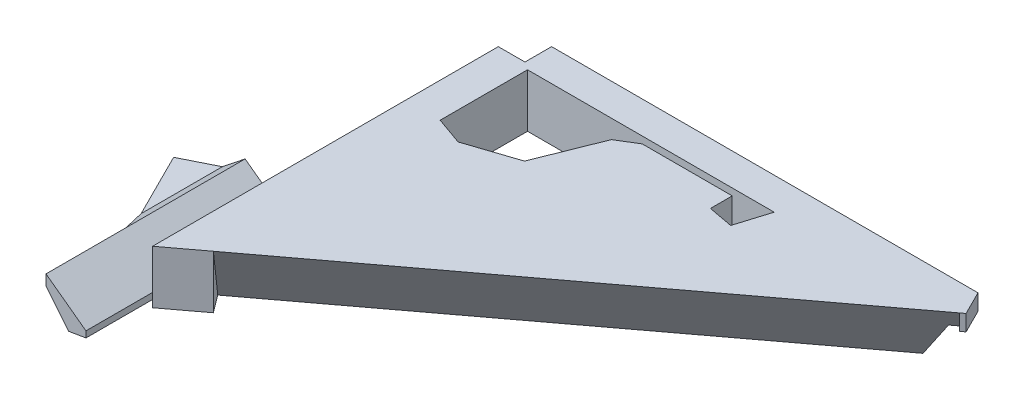
ISO-10303-21;
HEADER;
FILE_DESCRIPTION(('STEP AP214'),'2;1');
FILE_NAME('part.step','',(''),(''),'','','');
FILE_SCHEMA(('AUTOMOTIVE_DESIGN { 1 0 10303 214 1 1 1 1 }'));
ENDSEC;
DATA;
#1=APPLICATION_CONTEXT('core data for automotive mechanical design processes');
#2=APPLICATION_PROTOCOL_DEFINITION('international standard','automotive_design',2000,#1);
#3=PRODUCT_CONTEXT('',#1,'mechanical');
#4=PRODUCT('Part','Part','',(#3));
#5=PRODUCT_RELATED_PRODUCT_CATEGORY('part','',(#4));
#6=PRODUCT_DEFINITION_FORMATION('','',#4);
#7=PRODUCT_DEFINITION_CONTEXT('part definition',#1,'design');
#8=PRODUCT_DEFINITION('design','',#6,#7);
#9=PRODUCT_DEFINITION_SHAPE('','',#8);
#10=(LENGTH_UNIT() NAMED_UNIT(*) SI_UNIT(.MILLI.,.METRE.));
#11=(NAMED_UNIT(*) PLANE_ANGLE_UNIT() SI_UNIT($,.RADIAN.));
#12=(NAMED_UNIT(*) SI_UNIT($,.STERADIAN.) SOLID_ANGLE_UNIT());
#13=UNCERTAINTY_MEASURE_WITH_UNIT(LENGTH_MEASURE(1.E-05),#10,'distance_accuracy_value','');
#14=(GEOMETRIC_REPRESENTATION_CONTEXT(3) GLOBAL_UNCERTAINTY_ASSIGNED_CONTEXT((#13)) GLOBAL_UNIT_ASSIGNED_CONTEXT((#10,
#11,#12)) REPRESENTATION_CONTEXT('',''));
#15=CARTESIAN_POINT('',(0.,0.,0.));
#16=DIRECTION('',(0.,0.,1.));
#17=DIRECTION('',(1.,0.,0.));
#18=AXIS2_PLACEMENT_3D('',#15,#16,#17);
#19=CARTESIAN_POINT('',(221.579612662849,25.4,-102.940774674301));
#20=DIRECTION('',(-0.599773924536635,0.,-0.800169506695876));
#21=DIRECTION('',(-0.800169506695877,0.,0.599773924536636));
#22=AXIS2_PLACEMENT_3D('',#19,#20,#21);
#23=PLANE('',#22);
#24=DIRECTION('',(0.,-1.,0.));
#25=VECTOR('',#24,1.);
#26=CARTESIAN_POINT('',(219.79086032495,25.4,-101.6));
#27=LINE('',#26,#25);
#28=CARTESIAN_POINT('',(219.79086032495,25.4,-101.6));
#29=VERTEX_POINT('',#28);
#30=CARTESIAN_POINT('',(219.79086032495,17.78,-101.6));
#31=VERTEX_POINT('',#30);
#32=EDGE_CURVE('E290',#29,#31,#27,.T.);
#33=ORIENTED_EDGE('',*,*,#32,.T.);
#34=DIRECTION('',(0.800169506695877,0.,-0.599773924536636));
#35=VECTOR('',#34,1.);
#36=CARTESIAN_POINT('',(221.579612662849,17.78,-102.940774674301));
#37=LINE('',#36,#35);
#38=CARTESIAN_POINT('',(221.579612662849,17.78,-102.940774674301));
#39=VERTEX_POINT('',#38);
#40=EDGE_CURVE('E373',#31,#39,#37,.T.);
#41=ORIENTED_EDGE('',*,*,#40,.T.);
#42=DIRECTION('',(0.,-1.,0.));
#43=VECTOR('',#42,1.);
#44=CARTESIAN_POINT('',(221.579612662849,25.4,-102.940774674301));
#45=LINE('',#44,#43);
#46=CARTESIAN_POINT('',(221.579612662849,25.4,-102.940774674301));
#47=VERTEX_POINT('',#46);
#48=EDGE_CURVE('E481',#47,#39,#45,.T.);
#49=ORIENTED_EDGE('',*,*,#48,.F.);
#50=DIRECTION('',(0.800169506695876,0.,-0.599773924536635));
#51=VECTOR('',#50,1.);
#52=CARTESIAN_POINT('',(221.579612662849,25.4,-102.940774674301));
#53=LINE('',#52,#51);
#54=EDGE_CURVE('E454',#29,#47,#53,.T.);
#55=ORIENTED_EDGE('',*,*,#54,.F.);
#56=EDGE_LOOP('',(#33,#41,#49,#55));
#57=FACE_BOUND('',#56,.T.);
#58=ADVANCED_FACE('F74',(#57),#23,.F.);
#59=CARTESIAN_POINT('',(0.,25.4,0.));
#60=DIRECTION('',(0.,1.,0.));
#61=DIRECTION('',(0.,0.,1.));
#62=AXIS2_PLACEMENT_3D('',#59,#60,#61);
#63=PLANE('',#62);
#64=DIRECTION('',(0.,0.,1.));
#65=VECTOR('',#64,1.);
#66=CARTESIAN_POINT('',(0.,25.4,0.));
#67=LINE('',#66,#65);
#68=CARTESIAN_POINT('',(0.,25.4,-101.6));
#69=VERTEX_POINT('',#68);
#70=CARTESIAN_POINT('',(0.,25.4,63.1461266284947));
#71=VERTEX_POINT('',#70);
#72=EDGE_CURVE('E462',#69,#71,#67,.T.);
#73=ORIENTED_EDGE('',*,*,#72,.T.);
#74=CARTESIAN_POINT('',(16.5478056241978,25.4,50.7425768323053));
#75=VERTEX_POINT('',#74);
#76=EDGE_CURVE('E450',#71,#75,#53,.T.);
#77=ORIENTED_EDGE('',*,*,#76,.T.);
#78=DIRECTION('',(0.800169506695876,0.,-0.599773924536635));
#79=VECTOR('',#78,1.);
#80=CARTESIAN_POINT('',(16.5478056241978,25.4,50.7425768323053));
#81=LINE('',#80,#79);
#82=EDGE_CURVE('E279',#75,#29,#81,.T.);
#83=ORIENTED_EDGE('',*,*,#82,.T.);
#84=ORIENTED_EDGE('',*,*,#54,.T.);
#85=DIRECTION('',(-0.447213595499958,0.,-0.894427190999916));
#86=VECTOR('',#85,1.);
#87=CARTESIAN_POINT('',(215.9,25.4,-114.3));
#88=LINE('',#87,#86);
#89=CARTESIAN_POINT('',(215.9,25.4,-114.3));
#90=VERTEX_POINT('',#89);
#91=EDGE_CURVE('E453',#47,#90,#88,.T.);
#92=ORIENTED_EDGE('',*,*,#91,.T.);
#93=DIRECTION('',(-1.,0.,0.));
#94=VECTOR('',#93,1.);
#95=CARTESIAN_POINT('',(12.7,25.4,-114.3));
#96=LINE('',#95,#94);
#97=CARTESIAN_POINT('',(12.7,25.4,-114.3));
#98=VERTEX_POINT('',#97);
#99=EDGE_CURVE('E456',#90,#98,#96,.T.);
#100=ORIENTED_EDGE('',*,*,#99,.T.);
#101=DIRECTION('',(0.,0.,1.));
#102=VECTOR('',#101,1.);
#103=CARTESIAN_POINT('',(12.7,25.4,-101.6));
#104=LINE('',#103,#102);
#105=CARTESIAN_POINT('',(12.7,25.4,-101.6));
#106=VERTEX_POINT('',#105);
#107=EDGE_CURVE('E458',#98,#106,#104,.T.);
#108=ORIENTED_EDGE('',*,*,#107,.T.);
#109=DIRECTION('',(-1.,0.,0.));
#110=VECTOR('',#109,1.);
#111=CARTESIAN_POINT('',(0.,25.4,-101.6));
#112=LINE('',#111,#110);
#113=EDGE_CURVE('E460',#106,#69,#112,.T.);
#114=ORIENTED_EDGE('',*,*,#113,.T.);
#115=EDGE_LOOP('',(#73,#77,#83,#84,#92,#100,#108,#114));
#116=FACE_BOUND('',#115,.T.);
#117=DIRECTION('',(0.,0.,1.));
#118=VECTOR('',#117,1.);
#119=CARTESIAN_POINT('',(16.51,25.4,-99.0165349054092));
#120=LINE('',#119,#118);
#121=CARTESIAN_POINT('',(16.51,25.4,-99.0165349054092));
#122=VERTEX_POINT('',#121);
#123=CARTESIAN_POINT('',(16.51,25.4,-57.3806995480997));
#124=VERTEX_POINT('',#123);
#125=EDGE_CURVE('E379',#122,#124,#120,.T.);
#126=ORIENTED_EDGE('',*,*,#125,.F.);
#127=DIRECTION('',(-1.,0.,0.));
#128=VECTOR('',#127,1.);
#129=CARTESIAN_POINT('',(16.51,25.4,-99.0165349054092));
#130=LINE('',#129,#128);
#131=CARTESIAN_POINT('',(134.056716312534,25.4,-99.0165349054092));
#132=VERTEX_POINT('',#131);
#133=EDGE_CURVE('E377',#132,#122,#130,.T.);
#134=ORIENTED_EDGE('',*,*,#133,.F.);
#135=DIRECTION('',(0.293383061672796,0.,-0.955994968147582));
#136=VECTOR('',#135,1.);
#137=CARTESIAN_POINT('',(134.056716312534,25.4,-99.0165349054092));
#138=LINE('',#137,#136);
#139=CARTESIAN_POINT('',(129.190216348279,25.4,-83.1589409059752));
#140=VERTEX_POINT('',#139);
#141=EDGE_CURVE('E397',#140,#132,#138,.T.);
#142=ORIENTED_EDGE('',*,*,#141,.F.);
#143=DIRECTION('',(0.9831624870048,0.,0.182733478450274));
#144=VECTOR('',#143,1.);
#145=CARTESIAN_POINT('',(117.328122685408,25.4,-85.3636646066556));
#146=LINE('',#145,#144);
#147=CARTESIAN_POINT('',(117.328122685408,25.4,-85.3636646066556));
#148=VERTEX_POINT('',#147);
#149=EDGE_CURVE('E394',#148,#140,#146,.T.);
#150=ORIENTED_EDGE('',*,*,#149,.F.);
#151=DIRECTION('',(0.,0.,1.));
#152=VECTOR('',#151,1.);
#153=CARTESIAN_POINT('',(117.328122685408,25.4,-95.7484772476874));
#154=LINE('',#153,#152);
#155=CARTESIAN_POINT('',(117.328122685408,25.4,-95.7484772476874));
#156=VERTEX_POINT('',#155);
#157=EDGE_CURVE('E392',#156,#148,#154,.T.);
#158=ORIENTED_EDGE('',*,*,#157,.F.);
#159=DIRECTION('',(1.,0.,0.));
#160=VECTOR('',#159,1.);
#161=CARTESIAN_POINT('',(74.4224736154345,25.4,-95.7484772476874));
#162=LINE('',#161,#160);
#163=CARTESIAN_POINT('',(74.4224736154345,25.4,-95.7484772476874));
#164=VERTEX_POINT('',#163);
#165=EDGE_CURVE('E390',#164,#156,#162,.T.);
#166=ORIENTED_EDGE('',*,*,#165,.F.);
#167=DIRECTION('',(0.852266353638154,0.,-0.523108079135014));
#168=VECTOR('',#167,1.);
#169=CARTESIAN_POINT('',(74.4224736154345,25.4,-95.7484772476874));
#170=LINE('',#169,#168);
#171=CARTESIAN_POINT('',(65.3393873147147,25.4,-90.1734175177049));
#172=VERTEX_POINT('',#171);
#173=EDGE_CURVE('E388',#172,#164,#170,.T.);
#174=ORIENTED_EDGE('',*,*,#173,.F.);
#175=DIRECTION('',(0.372041831222485,0.,-0.928215963997937));
#176=VECTOR('',#175,1.);
#177=CARTESIAN_POINT('',(65.3393873147147,25.4,-90.1734175177049));
#178=LINE('',#177,#176);
#179=CARTESIAN_POINT('',(53.4907103043079,25.4,-60.6118730075718));
#180=VERTEX_POINT('',#179);
#181=EDGE_CURVE('E386',#180,#172,#178,.T.);
#182=ORIENTED_EDGE('',*,*,#181,.F.);
#183=DIRECTION('',(0.94850247826447,0.,-0.316769709293926));
#184=VECTOR('',#183,1.);
#185=CARTESIAN_POINT('',(29.76139092757,25.4,-52.6870338290113));
#186=LINE('',#185,#184);
#187=CARTESIAN_POINT('',(29.76139092757,25.4,-52.6870338290113));
#188=VERTEX_POINT('',#187);
#189=EDGE_CURVE('E384',#188,#180,#186,.T.);
#190=ORIENTED_EDGE('',*,*,#189,.F.);
#191=DIRECTION('',(0.942616820823999,0.,0.3338765177422));
#192=VECTOR('',#191,1.);
#193=CARTESIAN_POINT('',(16.51,25.4,-57.3806995480997));
#194=LINE('',#193,#192);
#195=EDGE_CURVE('E382',#124,#188,#194,.T.);
#196=ORIENTED_EDGE('',*,*,#195,.F.);
#197=EDGE_LOOP('',(#126,#134,#142,#150,#158,#166,#174,#182,#190,#196));
#198=FACE_BOUND('',#197,.T.);
#199=ADVANCED_FACE('F523',(#116,#198),#63,.T.);
#200=CARTESIAN_POINT('',(0.,0.,0.));
#201=DIRECTION('',(0.,1.,0.));
#202=DIRECTION('',(0.,0.,1.));
#203=AXIS2_PLACEMENT_3D('',#200,#201,#202);
#204=PLANE('',#203);
#205=DIRECTION('',(-1.,0.,0.));
#206=VECTOR('',#205,1.);
#207=CARTESIAN_POINT('',(0.,0.,-101.6));
#208=LINE('',#207,#206);
#209=CARTESIAN_POINT('',(202.384780424736,0.,-101.6));
#210=VERTEX_POINT('',#209);
#211=CARTESIAN_POINT('',(0.,0.,-101.6));
#212=VERTEX_POINT('',#211);
#213=EDGE_CURVE('E296',#210,#212,#208,.T.);
#214=ORIENTED_EDGE('',*,*,#213,.F.);
#215=DIRECTION('',(0.800169506695876,0.,-0.599773924536635));
#216=VECTOR('',#215,1.);
#217=CARTESIAN_POINT('',(10.2863380755884,0.,42.3890369490338));
#218=LINE('',#217,#216);
#219=CARTESIAN_POINT('',(10.2863380755884,0.,42.3890369490338));
#220=VERTEX_POINT('',#219);
#221=EDGE_CURVE('E276',#220,#210,#218,.T.);
#222=ORIENTED_EDGE('',*,*,#221,.F.);
#223=DIRECTION('',(-0.599773924536636,0.,-0.800169506695876));
#224=VECTOR('',#223,1.);
#225=CARTESIAN_POINT('',(16.5478056241978,0.,50.7425768323053));
#226=LINE('',#225,#224);
#227=CARTESIAN_POINT('',(16.5478056241978,0.,50.7425768323053));
#228=VERTEX_POINT('',#227);
#229=EDGE_CURVE('E283',#228,#220,#226,.T.);
#230=ORIENTED_EDGE('',*,*,#229,.F.);
#231=DIRECTION('',(0.800169506695876,0.,-0.599773924536635));
#232=VECTOR('',#231,1.);
#233=CARTESIAN_POINT('',(221.579612662849,0.,-102.940774674301));
#234=LINE('',#233,#232);
#235=CARTESIAN_POINT('',(0.,0.,63.1461266284947));
#236=VERTEX_POINT('',#235);
#237=EDGE_CURVE('E449',#236,#228,#234,.T.);
#238=ORIENTED_EDGE('',*,*,#237,.F.);
#239=DIRECTION('',(0.,0.,1.));
#240=VECTOR('',#239,1.);
#241=CARTESIAN_POINT('',(0.,0.,0.));
#242=LINE('',#241,#240);
#243=EDGE_CURVE('E466',#212,#236,#242,.T.);
#244=ORIENTED_EDGE('',*,*,#243,.F.);
#245=EDGE_LOOP('',(#214,#222,#230,#238,#244));
#246=FACE_BOUND('',#245,.T.);
#247=DIRECTION('',(-1.,0.,0.));
#248=VECTOR('',#247,1.);
#249=CARTESIAN_POINT('',(16.51,0.,-99.0165349054092));
#250=LINE('',#249,#248);
#251=CARTESIAN_POINT('',(134.056716312534,0.,-99.0165349054092));
#252=VERTEX_POINT('',#251);
#253=CARTESIAN_POINT('',(16.51,0.,-99.0165349054092));
#254=VERTEX_POINT('',#253);
#255=EDGE_CURVE('E376',#252,#254,#250,.T.);
#256=ORIENTED_EDGE('',*,*,#255,.T.);
#257=DIRECTION('',(0.,0.,1.));
#258=VECTOR('',#257,1.);
#259=CARTESIAN_POINT('',(16.51,0.,-99.0165349054092));
#260=LINE('',#259,#258);
#261=CARTESIAN_POINT('',(16.51,0.,-57.3806995480997));
#262=VERTEX_POINT('',#261);
#263=EDGE_CURVE('E402',#254,#262,#260,.T.);
#264=ORIENTED_EDGE('',*,*,#263,.T.);
#265=DIRECTION('',(0.942616820823999,0.,0.3338765177422));
#266=VECTOR('',#265,1.);
#267=CARTESIAN_POINT('',(16.51,0.,-57.3806995480997));
#268=LINE('',#267,#266);
#269=CARTESIAN_POINT('',(29.76139092757,0.,-52.6870338290113));
#270=VERTEX_POINT('',#269);
#271=EDGE_CURVE('E405',#262,#270,#268,.T.);
#272=ORIENTED_EDGE('',*,*,#271,.T.);
#273=DIRECTION('',(0.94850247826447,0.,-0.316769709293926));
#274=VECTOR('',#273,1.);
#275=CARTESIAN_POINT('',(29.76139092757,0.,-52.6870338290113));
#276=LINE('',#275,#274);
#277=CARTESIAN_POINT('',(53.4907103043079,0.,-60.6118730075718));
#278=VERTEX_POINT('',#277);
#279=EDGE_CURVE('E408',#270,#278,#276,.T.);
#280=ORIENTED_EDGE('',*,*,#279,.T.);
#281=DIRECTION('',(0.372041831222485,0.,-0.928215963997937));
#282=VECTOR('',#281,1.);
#283=CARTESIAN_POINT('',(65.3393873147147,0.,-90.1734175177049));
#284=LINE('',#283,#282);
#285=CARTESIAN_POINT('',(65.3393873147147,0.,-90.1734175177049));
#286=VERTEX_POINT('',#285);
#287=EDGE_CURVE('E411',#278,#286,#284,.T.);
#288=ORIENTED_EDGE('',*,*,#287,.T.);
#289=DIRECTION('',(0.852266353638154,0.,-0.523108079135014));
#290=VECTOR('',#289,1.);
#291=CARTESIAN_POINT('',(74.4224736154345,0.,-95.7484772476874));
#292=LINE('',#291,#290);
#293=CARTESIAN_POINT('',(74.4224736154345,0.,-95.7484772476874));
#294=VERTEX_POINT('',#293);
#295=EDGE_CURVE('E414',#286,#294,#292,.T.);
#296=ORIENTED_EDGE('',*,*,#295,.T.);
#297=DIRECTION('',(1.,0.,0.));
#298=VECTOR('',#297,1.);
#299=CARTESIAN_POINT('',(74.4224736154345,0.,-95.7484772476874));
#300=LINE('',#299,#298);
#301=CARTESIAN_POINT('',(117.328122685408,0.,-95.7484772476874));
#302=VERTEX_POINT('',#301);
#303=EDGE_CURVE('E417',#294,#302,#300,.T.);
#304=ORIENTED_EDGE('',*,*,#303,.T.);
#305=DIRECTION('',(0.,0.,1.));
#306=VECTOR('',#305,1.);
#307=CARTESIAN_POINT('',(117.328122685408,0.,-95.7484772476874));
#308=LINE('',#307,#306);
#309=CARTESIAN_POINT('',(117.328122685408,0.,-85.3636646066556));
#310=VERTEX_POINT('',#309);
#311=EDGE_CURVE('E420',#302,#310,#308,.T.);
#312=ORIENTED_EDGE('',*,*,#311,.T.);
#313=DIRECTION('',(0.9831624870048,0.,0.182733478450274));
#314=VECTOR('',#313,1.);
#315=CARTESIAN_POINT('',(117.328122685408,0.,-85.3636646066556));
#316=LINE('',#315,#314);
#317=CARTESIAN_POINT('',(129.190216348279,0.,-83.1589409059752));
#318=VERTEX_POINT('',#317);
#319=EDGE_CURVE('E423',#310,#318,#316,.T.);
#320=ORIENTED_EDGE('',*,*,#319,.T.);
#321=DIRECTION('',(0.293383061672796,0.,-0.955994968147582));
#322=VECTOR('',#321,1.);
#323=CARTESIAN_POINT('',(134.056716312534,0.,-99.0165349054092));
#324=LINE('',#323,#322);
#325=EDGE_CURVE('E380',#318,#252,#324,.T.);
#326=ORIENTED_EDGE('',*,*,#325,.T.);
#327=EDGE_LOOP('',(#256,#264,#272,#280,#288,#296,#304,#312,#320,#326));
#328=FACE_BOUND('',#327,.T.);
#329=ADVANCED_FACE('F293',(#246,#328),#204,.F.);
#330=CARTESIAN_POINT('',(-19.05,25.4,0.));
#331=DIRECTION('',(0.,0.,1.));
#332=DIRECTION('',(1.,0.,0.));
#333=AXIS2_PLACEMENT_3D('',#330,#331,#332);
#334=PLANE('',#333);
#335=DIRECTION('',(0.,-1.,0.));
#336=VECTOR('',#335,1.);
#337=CARTESIAN_POINT('',(-19.05,25.4,0.));
#338=LINE('',#337,#336);
#339=CARTESIAN_POINT('',(-19.05,20.3380251635927,0.));
#340=VERTEX_POINT('',#339);
#341=CARTESIAN_POINT('',(-19.05,15.3141480435858,0.));
#342=VERTEX_POINT('',#341);
#343=EDGE_CURVE('E497',#340,#342,#338,.T.);
#344=ORIENTED_EDGE('',*,*,#343,.F.);
#345=DIRECTION('',(-0.806041138326849,0.591859513165715,0.));
#346=VECTOR('',#345,1.);
#347=CARTESIAN_POINT('',(3.02935078483259,4.12560971088779,0.));
#348=LINE('',#347,#346);
#349=CARTESIAN_POINT('',(0.,6.35,0.));
#350=VERTEX_POINT('',#349);
#351=EDGE_CURVE('E304',#350,#340,#348,.T.);
#352=ORIENTED_EDGE('',*,*,#351,.F.);
#353=DIRECTION('',(0.,-1.,0.));
#354=VECTOR('',#353,1.);
#355=CARTESIAN_POINT('',(0.,25.4,0.));
#356=LINE('',#355,#354);
#357=CARTESIAN_POINT('',(0.,3.40974356356947,0.));
#358=VERTEX_POINT('',#357);
#359=EDGE_CURVE('E97',#350,#358,#356,.T.);
#360=ORIENTED_EDGE('',*,*,#359,.T.);
#361=DIRECTION('',(0.986273449876479,0.165120204907664,0.));
#362=VECTOR('',#361,1.);
#363=CARTESIAN_POINT('',(-0.555289267197707,3.31677798937278,0.));
#364=LINE('',#363,#362);
#365=CARTESIAN_POINT('',(-8.25422711955252,2.02783505380921,0.));
#366=VERTEX_POINT('',#365);
#367=EDGE_CURVE('E335',#366,#358,#364,.T.);
#368=ORIENTED_EDGE('',*,*,#367,.F.);
#369=DIRECTION('',(0.630615269276735,-0.776095601169747,0.));
#370=VECTOR('',#369,1.);
#371=CARTESIAN_POINT('',(-3.97926380788836,-3.23334459563035,0.));
#372=LINE('',#371,#370);
#373=EDGE_CURVE('E330',#342,#366,#372,.T.);
#374=ORIENTED_EDGE('',*,*,#373,.F.);
#375=EDGE_LOOP('',(#344,#352,#360,#368,#374));
#376=FACE_BOUND('',#375,.T.);
#377=ADVANCED_FACE('F76',(#376),#334,.F.);
#378=CARTESIAN_POINT('',(-41.7684506513979,25.4,11.3592253256989));
#379=DIRECTION('',(0.447213595499958,0.,0.894427190999916));
#380=DIRECTION('',(0.894427190999916,0.,-0.447213595499958));
#381=AXIS2_PLACEMENT_3D('',#378,#379,#380);
#382=PLANE('',#381);
#383=DIRECTION('',(0.,-1.,0.));
#384=VECTOR('',#383,1.);
#385=CARTESIAN_POINT('',(-41.7684506513979,25.4,11.3592253256989));
#386=LINE('',#385,#384);
#387=CARTESIAN_POINT('',(-41.7684506513978,15.3141480435858,11.359225325699));
#388=VERTEX_POINT('',#387);
#389=CARTESIAN_POINT('',(-41.7684506513979,10.7271298035795,11.3592253256989));
#390=VERTEX_POINT('',#389);
#391=EDGE_CURVE('E495',#388,#390,#386,.T.);
#392=ORIENTED_EDGE('',*,*,#391,.F.);
#393=DIRECTION('',(0.894427190999916,0.,-0.447213595499958));
#394=VECTOR('',#393,1.);
#395=CARTESIAN_POINT('',(-41.7684506513979,15.3141480435858,11.3592253256989));
#396=LINE('',#395,#394);
#397=CARTESIAN_POINT('',(-26.2794909941801,15.3141480435858,3.61474549709005));
#398=VERTEX_POINT('',#397);
#399=EDGE_CURVE('E327',#388,#398,#396,.T.);
#400=ORIENTED_EDGE('',*,*,#399,.T.);
#401=DIRECTION('',(0.759648178869514,0.527890429374591,-0.379824089434757));
#402=VECTOR('',#401,1.);
#403=CARTESIAN_POINT('',(-33.4076308985714,10.3607012514523,7.17881544928569));
#404=LINE('',#403,#402);
#405=EDGE_CURVE('E324',#398,#340,#404,.T.);
#406=ORIENTED_EDGE('',*,*,#405,.T.);
#407=ORIENTED_EDGE('',*,*,#343,.T.);
#408=DIRECTION('',(-0.777892474865148,-0.493562682883562,0.388946237432574));
#409=VECTOR('',#408,1.);
#410=CARTESIAN_POINT('',(-32.3617935715706,6.86798773034258,6.65589678578532));
#411=LINE('',#410,#409);
#412=CARTESIAN_POINT('',(-26.2794909941801,10.7271298035795,3.61474549709005));
#413=VERTEX_POINT('',#412);
#414=EDGE_CURVE('E357',#342,#413,#411,.T.);
#415=ORIENTED_EDGE('',*,*,#414,.T.);
#416=DIRECTION('',(-0.894427190999916,0.,0.447213595499958));
#417=VECTOR('',#416,1.);
#418=CARTESIAN_POINT('',(-41.7684506513979,10.7271298035795,11.3592253256989));
#419=LINE('',#418,#417);
#420=EDGE_CURVE('E360',#413,#390,#419,.T.);
#421=ORIENTED_EDGE('',*,*,#420,.T.);
#422=EDGE_LOOP('',(#392,#400,#406,#407,#415,#421));
#423=FACE_BOUND('',#422,.T.);
#424=ADVANCED_FACE('F582',(#423),#382,.F.);
#425=CARTESIAN_POINT('',(-19.05,25.4,56.7961266284946));
#426=DIRECTION('',(0.894427190999916,0.,-0.447213595499958));
#427=DIRECTION('',(-0.447213595499958,0.,-0.894427190999916));
#428=AXIS2_PLACEMENT_3D('',#425,#426,#427);
#429=PLANE('',#428);
#430=DIRECTION('',(-0.427065610296312,-0.29677402600496,-0.854131220592624));
#431=VECTOR('',#430,1.);
#432=CARTESIAN_POINT('',(-18.4084352838108,20.7838576988654,58.079256060873));
#433=LINE('',#432,#431);
#434=CARTESIAN_POINT('',(-19.05,20.3380251635927,56.7961266284946));
#435=VERTEX_POINT('',#434);
#436=CARTESIAN_POINT('',(-26.2794909941801,15.3141480435858,42.3371446401345));
#437=VERTEX_POINT('',#436);
#438=EDGE_CURVE('E314',#435,#437,#433,.T.);
#439=ORIENTED_EDGE('',*,*,#438,.T.);
#440=DIRECTION('',(-0.447213595499958,0.,-0.894427190999916));
#441=VECTOR('',#440,1.);
#442=CARTESIAN_POINT('',(-19.05,15.3141480435858,56.7961266284946));
#443=LINE('',#442,#441);
#444=EDGE_CURVE('E502',#437,#388,#443,.T.);
#445=ORIENTED_EDGE('',*,*,#444,.T.);
#446=ORIENTED_EDGE('',*,*,#391,.T.);
#447=DIRECTION('',(0.447213595499958,0.,0.894427190999916));
#448=VECTOR('',#447,1.);
#449=CARTESIAN_POINT('',(-19.05,10.7271298035795,56.7961266284946));
#450=LINE('',#449,#448);
#451=CARTESIAN_POINT('',(-26.2794909941801,10.7271298035795,42.3371446401346));
#452=VERTEX_POINT('',#451);
#453=EDGE_CURVE('E499',#390,#452,#450,.T.);
#454=ORIENTED_EDGE('',*,*,#453,.T.);
#455=DIRECTION('',(0.430228965743723,0.272974696950891,0.860457931487447));
#456=VECTOR('',#455,1.);
#457=CARTESIAN_POINT('',(-17.8655011915922,16.06569716977,59.1651242453103));
#458=LINE('',#457,#456);
#459=CARTESIAN_POINT('',(-19.05,15.3141480435858,56.7961266284946));
#460=VERTEX_POINT('',#459);
#461=EDGE_CURVE('E345',#452,#460,#458,.T.);
#462=ORIENTED_EDGE('',*,*,#461,.T.);
#463=DIRECTION('',(0.,-1.,0.));
#464=VECTOR('',#463,1.);
#465=CARTESIAN_POINT('',(-19.05,25.4,56.7961266284946));
#466=LINE('',#465,#464);
#467=EDGE_CURVE('E493',#435,#460,#466,.T.);
#468=ORIENTED_EDGE('',*,*,#467,.F.);
#469=EDGE_LOOP('',(#439,#445,#446,#454,#462,#468));
#470=FACE_BOUND('',#469,.T.);
#471=ADVANCED_FACE('F579',(#470),#429,.F.);
#472=CARTESIAN_POINT('',(-19.05,25.4,94.8961266284946));
#473=DIRECTION('',(1.,0.,0.));
#474=DIRECTION('',(0.,0.,-1.));
#475=AXIS2_PLACEMENT_3D('',#472,#473,#474);
#476=PLANE('',#475);
#477=DIRECTION('',(0.,-1.,0.));
#478=VECTOR('',#477,1.);
#479=CARTESIAN_POINT('',(-19.05,25.4,94.8961266284946));
#480=LINE('',#479,#478);
#481=CARTESIAN_POINT('',(-19.05,20.3380251635927,94.8961266284946));
#482=VERTEX_POINT('',#481);
#483=CARTESIAN_POINT('',(-19.05,15.3141480435858,94.8961266284946));
#484=VERTEX_POINT('',#483);
#485=EDGE_CURVE('E491',#482,#484,#480,.T.);
#486=ORIENTED_EDGE('',*,*,#485,.F.);
#487=DIRECTION('',(0.,0.,-1.));
#488=VECTOR('',#487,1.);
#489=CARTESIAN_POINT('',(-19.05,20.3380251635927,94.8961266284946));
#490=LINE('',#489,#488);
#491=EDGE_CURVE('E315',#482,#435,#490,.T.);
#492=ORIENTED_EDGE('',*,*,#491,.T.);
#493=ORIENTED_EDGE('',*,*,#467,.T.);
#494=DIRECTION('',(0.,0.,-1.));
#495=VECTOR('',#494,1.);
#496=CARTESIAN_POINT('',(-19.05,15.3141480435858,94.8961266284946));
#497=LINE('',#496,#495);
#498=EDGE_CURVE('E349',#484,#460,#497,.T.);
#499=ORIENTED_EDGE('',*,*,#498,.F.);
#500=EDGE_LOOP('',(#486,#492,#493,#499));
#501=FACE_BOUND('',#500,.T.);
#502=ADVANCED_FACE('F572',(#501),#476,.F.);
#503=CARTESIAN_POINT('',(0.,25.4,94.8961266284946));
#504=DIRECTION('',(0.,0.,-1.));
#505=DIRECTION('',(-1.,0.,0.));
#506=AXIS2_PLACEMENT_3D('',#503,#504,#505);
#507=PLANE('',#506);
#508=DIRECTION('',(0.,-1.,0.));
#509=VECTOR('',#508,1.);
#510=CARTESIAN_POINT('',(0.,25.4,94.8961266284946));
#511=LINE('',#510,#509);
#512=CARTESIAN_POINT('',(0.,6.35,94.8961266284946));
#513=VERTEX_POINT('',#512);
#514=CARTESIAN_POINT('',(0.,3.40974356356946,94.8961266284946));
#515=VERTEX_POINT('',#514);
#516=EDGE_CURVE('E488',#513,#515,#511,.T.);
#517=ORIENTED_EDGE('',*,*,#516,.F.);
#518=DIRECTION('',(-0.806041138326849,0.591859513165715,0.));
#519=VECTOR('',#518,1.);
#520=CARTESIAN_POINT('',(3.02935078483259,4.12560971088779,94.8961266284946));
#521=LINE('',#520,#519);
#522=EDGE_CURVE('E305',#513,#482,#521,.T.);
#523=ORIENTED_EDGE('',*,*,#522,.T.);
#524=ORIENTED_EDGE('',*,*,#485,.T.);
#525=DIRECTION('',(0.630615269276735,-0.776095601169747,0.));
#526=VECTOR('',#525,1.);
#527=CARTESIAN_POINT('',(-3.97926380788836,-3.23334459563035,94.8961266284946));
#528=LINE('',#527,#526);
#529=CARTESIAN_POINT('',(-8.25422711955252,2.02783505380921,94.8961266284946));
#530=VERTEX_POINT('',#529);
#531=EDGE_CURVE('E331',#484,#530,#528,.T.);
#532=ORIENTED_EDGE('',*,*,#531,.T.);
#533=DIRECTION('',(0.986273449876479,0.165120204907664,0.));
#534=VECTOR('',#533,1.);
#535=CARTESIAN_POINT('',(-0.555289267197707,3.31677798937278,94.8961266284946));
#536=LINE('',#535,#534);
#537=EDGE_CURVE('E334',#530,#515,#536,.T.);
#538=ORIENTED_EDGE('',*,*,#537,.T.);
#539=EDGE_LOOP('',(#517,#523,#524,#532,#538));
#540=FACE_BOUND('',#539,.T.);
#541=ADVANCED_FACE('F567',(#540),#507,.F.);
#542=CARTESIAN_POINT('',(0.,25.4,63.1461266284946));
#543=DIRECTION('',(-1.,0.,0.));
#544=DIRECTION('',(0.,0.,1.));
#545=AXIS2_PLACEMENT_3D('',#542,#543,#544);
#546=PLANE('',#545);
#547=DIRECTION('',(0.,-1.,0.));
#548=VECTOR('',#547,1.);
#549=CARTESIAN_POINT('',(0.,25.4,63.1461266284946));
#550=LINE('',#549,#548);
#551=CARTESIAN_POINT('',(0.,6.35,63.1461266284947));
#552=VERTEX_POINT('',#551);
#553=CARTESIAN_POINT('',(0.,3.40974356356946,63.1461266284947));
#554=VERTEX_POINT('',#553);
#555=EDGE_CURVE('E489',#552,#554,#550,.T.);
#556=ORIENTED_EDGE('',*,*,#555,.F.);
#557=DIRECTION('',(0.,0.,-1.));
#558=VECTOR('',#557,1.);
#559=CARTESIAN_POINT('',(0.,6.35,94.8961266284946));
#560=LINE('',#559,#558);
#561=EDGE_CURVE('E319',#513,#552,#560,.T.);
#562=ORIENTED_EDGE('',*,*,#561,.F.);
#563=ORIENTED_EDGE('',*,*,#516,.T.);
#564=DIRECTION('',(0.,0.,-1.));
#565=VECTOR('',#564,1.);
#566=CARTESIAN_POINT('',(0.,3.40974356356946,94.8961266284946));
#567=LINE('',#566,#565);
#568=EDGE_CURVE('E342',#515,#554,#567,.T.);
#569=ORIENTED_EDGE('',*,*,#568,.T.);
#570=EDGE_LOOP('',(#556,#562,#563,#569));
#571=FACE_BOUND('',#570,.T.);
#572=ADVANCED_FACE('F562',(#571),#546,.F.);
#573=ORIENTED_EDGE('',*,*,#237,.T.);
#574=DIRECTION('',(0.,-1.,0.));
#575=VECTOR('',#574,1.);
#576=CARTESIAN_POINT('',(16.5478056241978,25.4,50.7425768323053));
#577=LINE('',#576,#575);
#578=EDGE_CURVE('E282',#75,#228,#577,.T.);
#579=ORIENTED_EDGE('',*,*,#578,.F.);
#580=ORIENTED_EDGE('',*,*,#76,.F.);
#581=EDGE_CURVE('E485',#71,#552,#550,.T.);
#582=ORIENTED_EDGE('',*,*,#581,.T.);
#583=ORIENTED_EDGE('',*,*,#555,.T.);
#584=EDGE_CURVE('E484',#554,#236,#550,.T.);
#585=ORIENTED_EDGE('',*,*,#584,.T.);
#586=EDGE_LOOP('',(#573,#579,#580,#582,#583,#585));
#587=FACE_BOUND('',#586,.T.);
#588=ADVANCED_FACE('F530',(#587),#23,.F.);
#589=CARTESIAN_POINT('',(215.9,25.4,-114.3));
#590=DIRECTION('',(-0.894427190999916,0.,0.447213595499958));
#591=DIRECTION('',(0.447213595499958,0.,0.894427190999916));
#592=AXIS2_PLACEMENT_3D('',#589,#590,#591);
#593=PLANE('',#592);
#594=ORIENTED_EDGE('',*,*,#48,.T.);
#595=DIRECTION('',(-0.447213595499958,0.,-0.894427190999916));
#596=VECTOR('',#595,1.);
#597=CARTESIAN_POINT('',(215.9,17.78,-114.3));
#598=LINE('',#597,#596);
#599=CARTESIAN_POINT('',(215.9,17.78,-114.3));
#600=VERTEX_POINT('',#599);
#601=EDGE_CURVE('E369',#39,#600,#598,.T.);
#602=ORIENTED_EDGE('',*,*,#601,.T.);
#603=DIRECTION('',(0.,-1.,0.));
#604=VECTOR('',#603,1.);
#605=CARTESIAN_POINT('',(215.9,25.4,-114.3));
#606=LINE('',#605,#604);
#607=EDGE_CURVE('E478',#90,#600,#606,.T.);
#608=ORIENTED_EDGE('',*,*,#607,.F.);
#609=ORIENTED_EDGE('',*,*,#91,.F.);
#610=EDGE_LOOP('',(#594,#602,#608,#609));
#611=FACE_BOUND('',#610,.T.);
#612=ADVANCED_FACE('F515',(#611),#593,.F.);
#613=CARTESIAN_POINT('',(12.7,25.4,-114.3));
#614=DIRECTION('',(0.,0.,1.));
#615=DIRECTION('',(1.,0.,0.));
#616=AXIS2_PLACEMENT_3D('',#613,#614,#615);
#617=PLANE('',#616);
#618=ORIENTED_EDGE('',*,*,#607,.T.);
#619=DIRECTION('',(-1.,0.,0.));
#620=VECTOR('',#619,1.);
#621=CARTESIAN_POINT('',(221.579612662849,17.78,-114.3));
#622=LINE('',#621,#620);
#623=CARTESIAN_POINT('',(12.7,17.78,-114.3));
#624=VERTEX_POINT('',#623);
#625=EDGE_CURVE('E366',#600,#624,#622,.T.);
#626=ORIENTED_EDGE('',*,*,#625,.T.);
#627=DIRECTION('',(0.,-1.,0.));
#628=VECTOR('',#627,1.);
#629=CARTESIAN_POINT('',(12.7,25.4,-114.3));
#630=LINE('',#629,#628);
#631=EDGE_CURVE('E475',#98,#624,#630,.T.);
#632=ORIENTED_EDGE('',*,*,#631,.F.);
#633=ORIENTED_EDGE('',*,*,#99,.F.);
#634=EDGE_LOOP('',(#618,#626,#632,#633));
#635=FACE_BOUND('',#634,.T.);
#636=ADVANCED_FACE('F519',(#635),#617,.F.);
#637=CARTESIAN_POINT('',(12.7,25.4,-101.6));
#638=DIRECTION('',(1.,0.,0.));
#639=DIRECTION('',(0.,0.,-1.));
#640=AXIS2_PLACEMENT_3D('',#637,#638,#639);
#641=PLANE('',#640);
#642=ORIENTED_EDGE('',*,*,#631,.T.);
#643=DIRECTION('',(0.,0.,-1.));
#644=VECTOR('',#643,1.);
#645=CARTESIAN_POINT('',(12.7,17.78,-101.6));
#646=LINE('',#645,#644);
#647=CARTESIAN_POINT('',(12.7,17.78,-101.6));
#648=VERTEX_POINT('',#647);
#649=EDGE_CURVE('E363',#648,#624,#646,.T.);
#650=ORIENTED_EDGE('',*,*,#649,.F.);
#651=DIRECTION('',(0.,-1.,0.));
#652=VECTOR('',#651,1.);
#653=CARTESIAN_POINT('',(12.7,25.4,-101.6));
#654=LINE('',#653,#652);
#655=EDGE_CURVE('E472',#106,#648,#654,.T.);
#656=ORIENTED_EDGE('',*,*,#655,.F.);
#657=ORIENTED_EDGE('',*,*,#107,.F.);
#658=EDGE_LOOP('',(#642,#650,#656,#657));
#659=FACE_BOUND('',#658,.T.);
#660=ADVANCED_FACE('F544',(#659),#641,.F.);
#661=CARTESIAN_POINT('',(0.,25.4,-101.6));
#662=DIRECTION('',(0.,0.,1.));
#663=DIRECTION('',(1.,0.,0.));
#664=AXIS2_PLACEMENT_3D('',#661,#662,#663);
#665=PLANE('',#664);
#666=DIRECTION('',(-1.,0.,0.));
#667=VECTOR('',#666,1.);
#668=CARTESIAN_POINT('',(221.579612662849,17.78,-101.6));
#669=LINE('',#668,#667);
#670=CARTESIAN_POINT('',(214.569036354886,17.78,-101.6));
#671=VERTEX_POINT('',#670);
#672=EDGE_CURVE('E365',#671,#648,#669,.T.);
#673=ORIENTED_EDGE('',*,*,#672,.F.);
#674=DIRECTION('',(-0.565283954313478,-0.824896388036533,0.));
#675=VECTOR('',#674,1.);
#676=CARTESIAN_POINT('',(149.557581279946,-77.088630292976,-101.6));
#677=LINE('',#676,#675);
#678=EDGE_CURVE('E298',#671,#210,#677,.T.);
#679=ORIENTED_EDGE('',*,*,#678,.T.);
#680=ORIENTED_EDGE('',*,*,#213,.T.);
#681=DIRECTION('',(0.,-1.,0.));
#682=VECTOR('',#681,1.);
#683=CARTESIAN_POINT('',(0.,25.4,-101.6));
#684=LINE('',#683,#682);
#685=EDGE_CURVE('E469',#69,#212,#684,.T.);
#686=ORIENTED_EDGE('',*,*,#685,.F.);
#687=ORIENTED_EDGE('',*,*,#113,.F.);
#688=ORIENTED_EDGE('',*,*,#655,.T.);
#689=EDGE_LOOP('',(#673,#679,#680,#686,#687,#688));
#690=FACE_BOUND('',#689,.T.);
#691=ADVANCED_FACE('F541',(#690),#665,.F.);
#692=CARTESIAN_POINT('',(0.,25.4,0.));
#693=DIRECTION('',(1.,0.,0.));
#694=DIRECTION('',(0.,0.,-1.));
#695=AXIS2_PLACEMENT_3D('',#692,#693,#694);
#696=PLANE('',#695);
#697=ORIENTED_EDGE('',*,*,#243,.T.);
#698=ORIENTED_EDGE('',*,*,#584,.F.);
#699=EDGE_CURVE('E346',#554,#358,#567,.T.);
#700=ORIENTED_EDGE('',*,*,#699,.T.);
#701=ORIENTED_EDGE('',*,*,#359,.F.);
#702=EDGE_CURVE('E308',#552,#350,#560,.T.);
#703=ORIENTED_EDGE('',*,*,#702,.F.);
#704=ORIENTED_EDGE('',*,*,#581,.F.);
#705=ORIENTED_EDGE('',*,*,#72,.F.);
#706=ORIENTED_EDGE('',*,*,#685,.T.);
#707=EDGE_LOOP('',(#697,#698,#700,#701,#703,#704,#705,#706));
#708=FACE_BOUND('',#707,.T.);
#709=ADVANCED_FACE('F534',(#708),#696,.F.);
#710=CARTESIAN_POINT('',(16.51,25.4,-99.0165349054092));
#711=DIRECTION('',(0.,0.,1.));
#712=DIRECTION('',(1.,0.,0.));
#713=AXIS2_PLACEMENT_3D('',#710,#711,#712);
#714=PLANE('',#713);
#715=ORIENTED_EDGE('',*,*,#255,.F.);
#716=DIRECTION('',(0.,-1.,0.));
#717=VECTOR('',#716,1.);
#718=CARTESIAN_POINT('',(134.056716312534,25.4,-99.0165349054092));
#719=LINE('',#718,#717);
#720=EDGE_CURVE('E399',#132,#252,#719,.T.);
#721=ORIENTED_EDGE('',*,*,#720,.F.);
#722=ORIENTED_EDGE('',*,*,#133,.T.);
#723=DIRECTION('',(0.,-1.,0.));
#724=VECTOR('',#723,1.);
#725=CARTESIAN_POINT('',(16.51,25.4,-99.0165349054092));
#726=LINE('',#725,#724);
#727=EDGE_CURVE('E446',#122,#254,#726,.T.);
#728=ORIENTED_EDGE('',*,*,#727,.T.);
#729=EDGE_LOOP('',(#715,#721,#722,#728));
#730=FACE_BOUND('',#729,.T.);
#731=ADVANCED_FACE('F667',(#730),#714,.T.);
#732=CARTESIAN_POINT('',(16.51,25.4,-99.0165349054092));
#733=DIRECTION('',(1.,0.,0.));
#734=DIRECTION('',(0.,0.,-1.));
#735=AXIS2_PLACEMENT_3D('',#732,#733,#734);
#736=PLANE('',#735);
#737=ORIENTED_EDGE('',*,*,#263,.F.);
#738=ORIENTED_EDGE('',*,*,#727,.F.);
#739=ORIENTED_EDGE('',*,*,#125,.T.);
#740=DIRECTION('',(0.,-1.,0.));
#741=VECTOR('',#740,1.);
#742=CARTESIAN_POINT('',(16.51,25.4,-57.3806995480997));
#743=LINE('',#742,#741);
#744=EDGE_CURVE('E444',#124,#262,#743,.T.);
#745=ORIENTED_EDGE('',*,*,#744,.T.);
#746=EDGE_LOOP('',(#737,#738,#739,#745));
#747=FACE_BOUND('',#746,.T.);
#748=ADVANCED_FACE('F663',(#747),#736,.T.);
#749=CARTESIAN_POINT('',(16.51,25.4,-57.3806995480997));
#750=DIRECTION('',(0.3338765177422,0.,-0.942616820823999));
#751=DIRECTION('',(-0.942616820823999,0.,-0.3338765177422));
#752=AXIS2_PLACEMENT_3D('',#749,#750,#751);
#753=PLANE('',#752);
#754=ORIENTED_EDGE('',*,*,#271,.F.);
#755=ORIENTED_EDGE('',*,*,#744,.F.);
#756=ORIENTED_EDGE('',*,*,#195,.T.);
#757=DIRECTION('',(0.,-1.,0.));
#758=VECTOR('',#757,1.);
#759=CARTESIAN_POINT('',(29.76139092757,25.4,-52.6870338290113));
#760=LINE('',#759,#758);
#761=EDGE_CURVE('E442',#188,#270,#760,.T.);
#762=ORIENTED_EDGE('',*,*,#761,.T.);
#763=EDGE_LOOP('',(#754,#755,#756,#762));
#764=FACE_BOUND('',#763,.T.);
#765=ADVANCED_FACE('F659',(#764),#753,.T.);
#766=CARTESIAN_POINT('',(29.76139092757,25.4,-52.6870338290113));
#767=DIRECTION('',(-0.316769709293926,0.,-0.94850247826447));
#768=DIRECTION('',(-0.94850247826447,0.,0.316769709293926));
#769=AXIS2_PLACEMENT_3D('',#766,#767,#768);
#770=PLANE('',#769);
#771=ORIENTED_EDGE('',*,*,#279,.F.);
#772=ORIENTED_EDGE('',*,*,#761,.F.);
#773=ORIENTED_EDGE('',*,*,#189,.T.);
#774=DIRECTION('',(0.,-1.,0.));
#775=VECTOR('',#774,1.);
#776=CARTESIAN_POINT('',(53.4907103043079,25.4,-60.6118730075718));
#777=LINE('',#776,#775);
#778=EDGE_CURVE('E440',#180,#278,#777,.T.);
#779=ORIENTED_EDGE('',*,*,#778,.T.);
#780=EDGE_LOOP('',(#771,#772,#773,#779));
#781=FACE_BOUND('',#780,.T.);
#782=ADVANCED_FACE('F655',(#781),#770,.T.);
#783=CARTESIAN_POINT('',(65.3393873147147,25.4,-90.1734175177049));
#784=DIRECTION('',(-0.928215963997937,0.,-0.372041831222485));
#785=DIRECTION('',(-0.372041831222485,0.,0.928215963997937));
#786=AXIS2_PLACEMENT_3D('',#783,#784,#785);
#787=PLANE('',#786);
#788=ORIENTED_EDGE('',*,*,#287,.F.);
#789=ORIENTED_EDGE('',*,*,#778,.F.);
#790=ORIENTED_EDGE('',*,*,#181,.T.);
#791=DIRECTION('',(0.,-1.,0.));
#792=VECTOR('',#791,1.);
#793=CARTESIAN_POINT('',(65.3393873147147,25.4,-90.1734175177049));
#794=LINE('',#793,#792);
#795=EDGE_CURVE('E438',#172,#286,#794,.T.);
#796=ORIENTED_EDGE('',*,*,#795,.T.);
#797=EDGE_LOOP('',(#788,#789,#790,#796));
#798=FACE_BOUND('',#797,.T.);
#799=ADVANCED_FACE('F651',(#798),#787,.T.);
#800=CARTESIAN_POINT('',(74.4224736154345,25.4,-95.7484772476874));
#801=DIRECTION('',(-0.523108079135014,0.,-0.852266353638154));
#802=DIRECTION('',(-0.852266353638155,0.,0.523108079135014));
#803=AXIS2_PLACEMENT_3D('',#800,#801,#802);
#804=PLANE('',#803);
#805=ORIENTED_EDGE('',*,*,#295,.F.);
#806=ORIENTED_EDGE('',*,*,#795,.F.);
#807=ORIENTED_EDGE('',*,*,#173,.T.);
#808=DIRECTION('',(0.,-1.,0.));
#809=VECTOR('',#808,1.);
#810=CARTESIAN_POINT('',(74.4224736154345,25.4,-95.7484772476874));
#811=LINE('',#810,#809);
#812=EDGE_CURVE('E436',#164,#294,#811,.T.);
#813=ORIENTED_EDGE('',*,*,#812,.T.);
#814=EDGE_LOOP('',(#805,#806,#807,#813));
#815=FACE_BOUND('',#814,.T.);
#816=ADVANCED_FACE('F647',(#815),#804,.T.);
#817=CARTESIAN_POINT('',(74.4224736154345,25.4,-95.7484772476874));
#818=DIRECTION('',(0.,0.,-1.));
#819=DIRECTION('',(-1.,0.,0.));
#820=AXIS2_PLACEMENT_3D('',#817,#818,#819);
#821=PLANE('',#820);
#822=ORIENTED_EDGE('',*,*,#303,.F.);
#823=ORIENTED_EDGE('',*,*,#812,.F.);
#824=ORIENTED_EDGE('',*,*,#165,.T.);
#825=DIRECTION('',(0.,-1.,0.));
#826=VECTOR('',#825,1.);
#827=CARTESIAN_POINT('',(117.328122685408,25.4,-95.7484772476874));
#828=LINE('',#827,#826);
#829=EDGE_CURVE('E434',#156,#302,#828,.T.);
#830=ORIENTED_EDGE('',*,*,#829,.T.);
#831=EDGE_LOOP('',(#822,#823,#824,#830));
#832=FACE_BOUND('',#831,.T.);
#833=ADVANCED_FACE('F643',(#832),#821,.T.);
#834=CARTESIAN_POINT('',(117.328122685408,25.4,-95.7484772476874));
#835=DIRECTION('',(1.,0.,0.));
#836=DIRECTION('',(0.,0.,-1.));
#837=AXIS2_PLACEMENT_3D('',#834,#835,#836);
#838=PLANE('',#837);
#839=ORIENTED_EDGE('',*,*,#311,.F.);
#840=ORIENTED_EDGE('',*,*,#829,.F.);
#841=ORIENTED_EDGE('',*,*,#157,.T.);
#842=DIRECTION('',(0.,-1.,0.));
#843=VECTOR('',#842,1.);
#844=CARTESIAN_POINT('',(117.328122685408,25.4,-85.3636646066556));
#845=LINE('',#844,#843);
#846=EDGE_CURVE('E432',#148,#310,#845,.T.);
#847=ORIENTED_EDGE('',*,*,#846,.T.);
#848=EDGE_LOOP('',(#839,#840,#841,#847));
#849=FACE_BOUND('',#848,.T.);
#850=ADVANCED_FACE('F639',(#849),#838,.T.);
#851=CARTESIAN_POINT('',(117.328122685408,25.4,-85.3636646066556));
#852=DIRECTION('',(0.182733478450274,0.,-0.9831624870048));
#853=DIRECTION('',(-0.9831624870048,0.,-0.182733478450274));
#854=AXIS2_PLACEMENT_3D('',#851,#852,#853);
#855=PLANE('',#854);
#856=ORIENTED_EDGE('',*,*,#319,.F.);
#857=ORIENTED_EDGE('',*,*,#846,.F.);
#858=ORIENTED_EDGE('',*,*,#149,.T.);
#859=DIRECTION('',(0.,-1.,0.));
#860=VECTOR('',#859,1.);
#861=CARTESIAN_POINT('',(129.190216348279,25.4,-83.1589409059752));
#862=LINE('',#861,#860);
#863=EDGE_CURVE('E430',#140,#318,#862,.T.);
#864=ORIENTED_EDGE('',*,*,#863,.T.);
#865=EDGE_LOOP('',(#856,#857,#858,#864));
#866=FACE_BOUND('',#865,.T.);
#867=ADVANCED_FACE('F635',(#866),#855,.T.);
#868=CARTESIAN_POINT('',(134.056716312534,25.4,-99.0165349054092));
#869=DIRECTION('',(-0.955994968147582,0.,-0.293383061672796));
#870=DIRECTION('',(-0.293383061672796,0.,0.955994968147582));
#871=AXIS2_PLACEMENT_3D('',#868,#869,#870);
#872=PLANE('',#871);
#873=ORIENTED_EDGE('',*,*,#325,.F.);
#874=ORIENTED_EDGE('',*,*,#863,.F.);
#875=ORIENTED_EDGE('',*,*,#141,.T.);
#876=ORIENTED_EDGE('',*,*,#720,.T.);
#877=EDGE_LOOP('',(#873,#874,#875,#876));
#878=FACE_BOUND('',#877,.T.);
#879=ADVANCED_FACE('F632',(#878),#872,.T.);
#880=CARTESIAN_POINT('',(221.579612662849,17.78,-101.6));
#881=DIRECTION('',(0.,1.,0.));
#882=DIRECTION('',(0.,0.,1.));
#883=AXIS2_PLACEMENT_3D('',#880,#881,#882);
#884=PLANE('',#883);
#885=DIRECTION('',(0.599773924536636,0.,0.800169506695876));
#886=VECTOR('',#885,1.);
#887=CARTESIAN_POINT('',(220.434325986401,17.78,-100.741540537468));
#888=LINE('',#887,#886);
#889=CARTESIAN_POINT('',(217.912420060368,17.78,-104.106061964982));
#890=VERTEX_POINT('',#889);
#891=EDGE_CURVE('E82',#890,#31,#888,.T.);
#892=ORIENTED_EDGE('',*,*,#891,.F.);
#893=DIRECTION('',(-0.800169506695877,0.,0.599773924536635));
#894=VECTOR('',#893,1.);
#895=CARTESIAN_POINT('',(219.057706736816,17.78,-104.964521427514));
#896=LINE('',#895,#894);
#897=EDGE_CURVE('E12',#890,#671,#896,.T.);
#898=ORIENTED_EDGE('',*,*,#897,.T.);
#899=ORIENTED_EDGE('',*,*,#672,.T.);
#900=ORIENTED_EDGE('',*,*,#649,.T.);
#901=ORIENTED_EDGE('',*,*,#625,.F.);
#902=ORIENTED_EDGE('',*,*,#601,.F.);
#903=ORIENTED_EDGE('',*,*,#40,.F.);
#904=EDGE_LOOP('',(#892,#898,#899,#900,#901,#902,#903));
#905=FACE_BOUND('',#904,.T.);
#906=ADVANCED_FACE('F512',(#905),#884,.F.);
#907=CARTESIAN_POINT('',(0.,10.7271298035795,94.8961266284946));
#908=DIRECTION('',(0.,1.,0.));
#909=DIRECTION('',(0.,0.,1.));
#910=AXIS2_PLACEMENT_3D('',#907,#908,#909);
#911=PLANE('',#910);
#912=DIRECTION('',(0.,0.,-1.));
#913=VECTOR('',#912,1.);
#914=CARTESIAN_POINT('',(-26.2794909941801,10.7271298035795,94.8961266284946));
#915=LINE('',#914,#913);
#916=EDGE_CURVE('E338',#452,#413,#915,.T.);
#917=ORIENTED_EDGE('',*,*,#916,.F.);
#918=ORIENTED_EDGE('',*,*,#453,.F.);
#919=ORIENTED_EDGE('',*,*,#420,.F.);
#920=EDGE_LOOP('',(#917,#918,#919));
#921=FACE_BOUND('',#920,.T.);
#922=ADVANCED_FACE('F593',(#921),#911,.F.);
#923=CARTESIAN_POINT('',(-12.3955395748528,19.536316848018,94.8961266284946));
#924=DIRECTION('',(-0.53574717188647,0.844378450586969,0.));
#925=DIRECTION('',(-0.844378450586969,-0.53574717188647,0.));
#926=AXIS2_PLACEMENT_3D('',#923,#924,#925);
#927=PLANE('',#926);
#928=EDGE_CURVE('E352',#460,#342,#497,.T.);
#929=ORIENTED_EDGE('',*,*,#928,.F.);
#930=ORIENTED_EDGE('',*,*,#461,.F.);
#931=ORIENTED_EDGE('',*,*,#916,.T.);
#932=ORIENTED_EDGE('',*,*,#414,.F.);
#933=EDGE_LOOP('',(#929,#930,#931,#932));
#934=FACE_BOUND('',#933,.T.);
#935=ADVANCED_FACE('F597',(#934),#927,.F.);
#936=CARTESIAN_POINT('',(-0.555289267197707,3.31677798937278,94.8961266284946));
#937=DIRECTION('',(-0.165120204907664,0.986273449876479,0.));
#938=DIRECTION('',(-0.986273449876479,-0.165120204907664,0.));
#939=AXIS2_PLACEMENT_3D('',#936,#937,#938);
#940=PLANE('',#939);
#941=ORIENTED_EDGE('',*,*,#367,.T.);
#942=ORIENTED_EDGE('',*,*,#699,.F.);
#943=ORIENTED_EDGE('',*,*,#568,.F.);
#944=ORIENTED_EDGE('',*,*,#537,.F.);
#945=DIRECTION('',(0.,0.,-1.));
#946=VECTOR('',#945,1.);
#947=CARTESIAN_POINT('',(-8.25422711955252,2.02783505380921,94.8961266284946));
#948=LINE('',#947,#946);
#949=EDGE_CURVE('E347',#530,#366,#948,.T.);
#950=ORIENTED_EDGE('',*,*,#949,.T.);
#951=EDGE_LOOP('',(#941,#942,#943,#944,#950));
#952=FACE_BOUND('',#951,.T.);
#953=ADVANCED_FACE('F615',(#952),#940,.F.);
#954=CARTESIAN_POINT('',(-3.97926380788836,-3.23334459563035,94.8961266284946));
#955=DIRECTION('',(0.776095601169747,0.630615269276735,0.));
#956=DIRECTION('',(-0.630615269276735,0.776095601169747,0.));
#957=AXIS2_PLACEMENT_3D('',#954,#955,#956);
#958=PLANE('',#957);
#959=ORIENTED_EDGE('',*,*,#373,.T.);
#960=ORIENTED_EDGE('',*,*,#949,.F.);
#961=ORIENTED_EDGE('',*,*,#531,.F.);
#962=ORIENTED_EDGE('',*,*,#498,.T.);
#963=ORIENTED_EDGE('',*,*,#928,.T.);
#964=EDGE_LOOP('',(#959,#960,#961,#962,#963));
#965=FACE_BOUND('',#964,.T.);
#966=ADVANCED_FACE('F602',(#965),#958,.F.);
#967=CARTESIAN_POINT('',(0.,15.3141480435858,94.8961266284946));
#968=DIRECTION('',(0.,-1.,0.));
#969=DIRECTION('',(0.,0.,-1.));
#970=AXIS2_PLACEMENT_3D('',#967,#968,#969);
#971=PLANE('',#970);
#972=ORIENTED_EDGE('',*,*,#444,.F.);
#973=DIRECTION('',(0.,0.,-1.));
#974=VECTOR('',#973,1.);
#975=CARTESIAN_POINT('',(-26.2794909941801,15.3141480435858,94.8961266284946));
#976=LINE('',#975,#974);
#977=EDGE_CURVE('E311',#437,#398,#976,.T.);
#978=ORIENTED_EDGE('',*,*,#977,.T.);
#979=ORIENTED_EDGE('',*,*,#399,.F.);
#980=EDGE_LOOP('',(#972,#978,#979));
#981=FACE_BOUND('',#980,.T.);
#982=ADVANCED_FACE('F622',(#981),#971,.F.);
#983=CARTESIAN_POINT('',(-15.7343385062344,22.642125954316,94.8961266284946));
#984=DIRECTION('',(0.570656121664392,-0.821189132177816,0.));
#985=DIRECTION('',(0.821189132177816,0.570656121664392,0.));
#986=AXIS2_PLACEMENT_3D('',#983,#984,#985);
#987=PLANE('',#986);
#988=ORIENTED_EDGE('',*,*,#977,.F.);
#989=ORIENTED_EDGE('',*,*,#438,.F.);
#990=EDGE_CURVE('E318',#435,#340,#490,.T.);
#991=ORIENTED_EDGE('',*,*,#990,.T.);
#992=ORIENTED_EDGE('',*,*,#405,.F.);
#993=EDGE_LOOP('',(#988,#989,#991,#992));
#994=FACE_BOUND('',#993,.T.);
#995=ADVANCED_FACE('F752',(#994),#987,.F.);
#996=CARTESIAN_POINT('',(3.02935078483259,4.12560971088779,94.8961266284946));
#997=DIRECTION('',(-0.591859513165715,-0.806041138326849,0.));
#998=DIRECTION('',(0.806041138326849,-0.591859513165715,0.));
#999=AXIS2_PLACEMENT_3D('',#996,#997,#998);
#1000=PLANE('',#999);
#1001=ORIENTED_EDGE('',*,*,#351,.T.);
#1002=ORIENTED_EDGE('',*,*,#990,.F.);
#1003=ORIENTED_EDGE('',*,*,#491,.F.);
#1004=ORIENTED_EDGE('',*,*,#522,.F.);
#1005=ORIENTED_EDGE('',*,*,#561,.T.);
#1006=ORIENTED_EDGE('',*,*,#702,.T.);
#1007=EDGE_LOOP('',(#1001,#1002,#1003,#1004,#1005,#1006));
#1008=FACE_BOUND('',#1007,.T.);
#1009=ADVANCED_FACE('F610',(#1008),#1000,.F.);
#1010=CARTESIAN_POINT('',(10.2863380755884,0.,42.3890369490338));
#1011=DIRECTION('',(-0.554744645928052,0.380154709891337,-0.740095111699566));
#1012=DIRECTION('',(-0.800169506695877,0.,0.599773924536635));
#1013=AXIS2_PLACEMENT_3D('',#1010,#1011,#1012);
#1014=PLANE('',#1013);
#1015=ORIENTED_EDGE('',*,*,#897,.F.);
#1016=DIRECTION('',(0.228006882282613,0.924922913840626,0.304188206681865));
#1017=VECTOR('',#1016,1.);
#1018=CARTESIAN_POINT('',(213.529392776341,0.,-109.953539883272));
#1019=LINE('',#1018,#1017);
#1020=EDGE_CURVE('E89',#890,#29,#1019,.T.);
#1021=ORIENTED_EDGE('',*,*,#1020,.T.);
#1022=ORIENTED_EDGE('',*,*,#82,.F.);
#1023=DIRECTION('',(0.228006882282613,0.924922913840626,0.304188206681865));
#1024=VECTOR('',#1023,1.);
#1025=CARTESIAN_POINT('',(10.2863380755884,0.,42.3890369490338));
#1026=LINE('',#1025,#1024);
#1027=EDGE_CURVE('E272',#220,#75,#1026,.T.);
#1028=ORIENTED_EDGE('',*,*,#1027,.F.);
#1029=ORIENTED_EDGE('',*,*,#221,.T.);
#1030=ORIENTED_EDGE('',*,*,#678,.F.);
#1031=EDGE_LOOP('',(#1015,#1021,#1022,#1028,#1029,#1030));
#1032=FACE_BOUND('',#1031,.T.);
#1033=ADVANCED_FACE('F274',(#1032),#1014,.F.);
#1034=CARTESIAN_POINT('',(189.485720380215,0.,-142.030648762636));
#1035=DIRECTION('',(-0.800169506695876,0.,0.599773924536636));
#1036=DIRECTION('',(0.599773924536636,0.,0.800169506695876));
#1037=AXIS2_PLACEMENT_3D('',#1034,#1035,#1036);
#1038=PLANE('',#1037);
#1039=ORIENTED_EDGE('',*,*,#891,.T.);
#1040=ORIENTED_EDGE('',*,*,#32,.F.);
#1041=ORIENTED_EDGE('',*,*,#1020,.F.);
#1042=EDGE_LOOP('',(#1039,#1040,#1041));
#1043=FACE_BOUND('',#1042,.T.);
#1044=ADVANCED_FACE('F506',(#1043),#1038,.T.);
#1045=CARTESIAN_POINT('',(-13.7573343205373,0.,10.3119280696697));
#1046=DIRECTION('',(-0.800169506695876,0.,0.599773924536636));
#1047=DIRECTION('',(0.599773924536636,0.,0.800169506695876));
#1048=AXIS2_PLACEMENT_3D('',#1045,#1046,#1047);
#1049=PLANE('',#1048);
#1050=ORIENTED_EDGE('',*,*,#229,.T.);
#1051=ORIENTED_EDGE('',*,*,#1027,.T.);
#1052=ORIENTED_EDGE('',*,*,#578,.T.);
#1053=EDGE_LOOP('',(#1050,#1051,#1052));
#1054=FACE_BOUND('',#1053,.T.);
#1055=ADVANCED_FACE('F286',(#1054),#1049,.F.);
#1056=CLOSED_SHELL('',(#58,#199,#329,#377,#424,#471,#502,#541,#572,#588,#612,#636,#660,#691,
#709,#731,#748,#765,#782,#799,#816,#833,#850,#867,#879,#906,#922,#935,#953,#966,#982,#995,#1009,
#1033,#1044,#1055));
#1057=MANIFOLD_SOLID_BREP('B2',#1056);
#1058=ADVANCED_BREP_SHAPE_REPRESENTATION('',(#18,#1057),#14);
#1059=SHAPE_DEFINITION_REPRESENTATION(#9,#1058);
ENDSEC;
END-ISO-10303-21;
